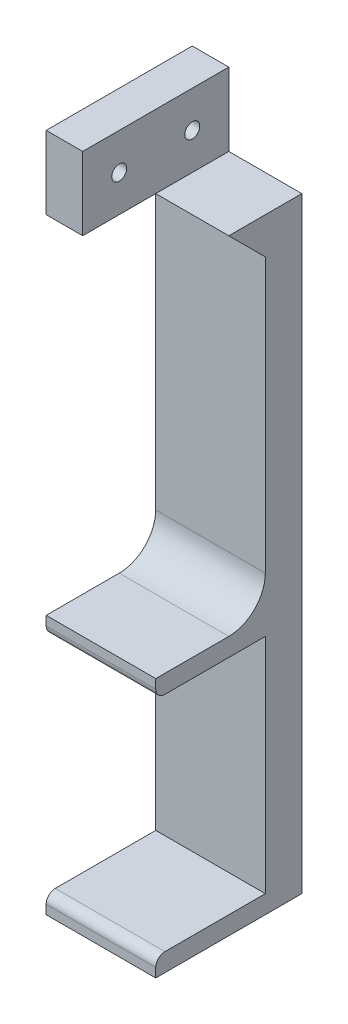
ISO-10303-21;
HEADER;
FILE_DESCRIPTION(('STEP AP214'),'2;1');
FILE_NAME('part.step','',(''),(''),'','','');
FILE_SCHEMA(('AUTOMOTIVE_DESIGN { 1 0 10303 214 1 1 1 1 }'));
ENDSEC;
DATA;
#1=APPLICATION_CONTEXT('core data for automotive mechanical design processes');
#2=APPLICATION_PROTOCOL_DEFINITION('international standard','automotive_design',2000,#1);
#3=PRODUCT_CONTEXT('',#1,'mechanical');
#4=PRODUCT('Part','Part','',(#3));
#5=PRODUCT_RELATED_PRODUCT_CATEGORY('part','',(#4));
#6=PRODUCT_DEFINITION_FORMATION('','',#4);
#7=PRODUCT_DEFINITION_CONTEXT('part definition',#1,'design');
#8=PRODUCT_DEFINITION('design','',#6,#7);
#9=PRODUCT_DEFINITION_SHAPE('','',#8);
#10=(LENGTH_UNIT() NAMED_UNIT(*) SI_UNIT(.MILLI.,.METRE.));
#11=(NAMED_UNIT(*) PLANE_ANGLE_UNIT() SI_UNIT($,.RADIAN.));
#12=(NAMED_UNIT(*) SI_UNIT($,.STERADIAN.) SOLID_ANGLE_UNIT());
#13=UNCERTAINTY_MEASURE_WITH_UNIT(LENGTH_MEASURE(1.E-05),#10,'distance_accuracy_value','');
#14=(GEOMETRIC_REPRESENTATION_CONTEXT(3) GLOBAL_UNCERTAINTY_ASSIGNED_CONTEXT((#13)) GLOBAL_UNIT_ASSIGNED_CONTEXT((#10,
#11,#12)) REPRESENTATION_CONTEXT('',''));
#15=CARTESIAN_POINT('',(0.,0.,0.));
#16=DIRECTION('',(0.,0.,1.));
#17=DIRECTION('',(1.,0.,0.));
#18=AXIS2_PLACEMENT_3D('',#15,#16,#17);
#19=CARTESIAN_POINT('',(-1.79629920025091,150.330357142857,30.));
#20=DIRECTION('',(-1.,0.,0.));
#21=DIRECTION('',(0.,-1.,0.));
#22=AXIS2_PLACEMENT_3D('',#19,#20,#21);
#23=CYLINDRICAL_SURFACE('',#22,2.04999999999999);
#24=CARTESIAN_POINT('',(-1.79629920025091,150.330357142857,30.));
#25=DIRECTION('',(-1.,0.,0.));
#26=DIRECTION('',(0.,-1.,0.));
#27=AXIS2_PLACEMENT_3D('',#24,#25,#26);
#28=CIRCLE('',#27,2.04999999999999);
#29=CARTESIAN_POINT('',(-1.79629920025091,148.280357142857,30.));
#30=VERTEX_POINT('',#29);
#31=EDGE_CURVE('E341',#30,#30,#28,.T.);
#32=ORIENTED_EDGE('',*,*,#31,.F.);
#33=EDGE_LOOP('',(#32));
#34=FACE_BOUND('',#33,.T.);
#35=CARTESIAN_POINT('',(-7.79629920025091,150.330357142857,30.));
#36=DIRECTION('',(-1.,0.,0.));
#37=DIRECTION('',(0.,-1.,0.));
#38=AXIS2_PLACEMENT_3D('',#35,#36,#37);
#39=CIRCLE('',#38,2.04999999999999);
#40=CARTESIAN_POINT('',(-7.79629920025091,148.280357142857,30.));
#41=VERTEX_POINT('',#40);
#42=EDGE_CURVE('E43',#41,#41,#39,.F.);
#43=ORIENTED_EDGE('',*,*,#42,.F.);
#44=EDGE_LOOP('',(#43));
#45=FACE_BOUND('',#44,.T.);
#46=ADVANCED_FACE('F39',(#34,#45),#23,.F.);
#47=CARTESIAN_POINT('',(-1.79629920025091,150.330357142857,10.));
#48=DIRECTION('',(-1.,0.,0.));
#49=DIRECTION('',(0.,-1.,0.));
#50=AXIS2_PLACEMENT_3D('',#47,#48,#49);
#51=CYLINDRICAL_SURFACE('',#50,2.05);
#52=CARTESIAN_POINT('',(-1.79629920025091,150.330357142857,10.));
#53=DIRECTION('',(-1.,0.,0.));
#54=DIRECTION('',(0.,-1.,0.));
#55=AXIS2_PLACEMENT_3D('',#52,#53,#54);
#56=CIRCLE('',#55,2.05);
#57=CARTESIAN_POINT('',(-1.79629920025091,148.280357142857,10.));
#58=VERTEX_POINT('',#57);
#59=EDGE_CURVE('E359',#58,#58,#56,.T.);
#60=ORIENTED_EDGE('',*,*,#59,.F.);
#61=EDGE_LOOP('',(#60));
#62=FACE_BOUND('',#61,.T.);
#63=CARTESIAN_POINT('',(-7.79629920025091,150.330357142857,10.));
#64=DIRECTION('',(-1.,0.,0.));
#65=DIRECTION('',(0.,-1.,0.));
#66=AXIS2_PLACEMENT_3D('',#63,#64,#65);
#67=CIRCLE('',#66,2.05);
#68=CARTESIAN_POINT('',(-7.79629920025091,148.280357142857,10.));
#69=VERTEX_POINT('',#68);
#70=EDGE_CURVE('E332',#69,#69,#67,.F.);
#71=ORIENTED_EDGE('',*,*,#70,.F.);
#72=EDGE_LOOP('',(#71));
#73=FACE_BOUND('',#72,.T.);
#74=ADVANCED_FACE('F433',(#62,#73),#51,.F.);
#75=CARTESIAN_POINT('',(0.,0.,10.));
#76=DIRECTION('',(0.,0.,1.));
#77=DIRECTION('',(1.,0.,0.));
#78=AXIS2_PLACEMENT_3D('',#75,#76,#77);
#79=PLANE('',#78);
#80=DIRECTION('',(0.,1.,0.));
#81=VECTOR('',#80,1.);
#82=CARTESIAN_POINT('',(18.2037007997491,160.330357142857,10.));
#83=LINE('',#82,#81);
#84=CARTESIAN_POINT('',(18.2037007997491,55.3303571428572,10.));
#85=VERTEX_POINT('',#84);
#86=CARTESIAN_POINT('',(18.2037007997491,130.330357142857,10.));
#87=VERTEX_POINT('',#86);
#88=EDGE_CURVE('E254',#85,#87,#83,.T.);
#89=ORIENTED_EDGE('',*,*,#88,.T.);
#90=DIRECTION('',(-1.,0.,0.));
#91=VECTOR('',#90,1.);
#92=CARTESIAN_POINT('',(1.2057980275635E-13,130.330357142857,10.));
#93=LINE('',#92,#91);
#94=CARTESIAN_POINT('',(-11.7962992002509,130.330357142857,10.));
#95=VERTEX_POINT('',#94);
#96=EDGE_CURVE('E328',#87,#95,#93,.T.);
#97=ORIENTED_EDGE('',*,*,#96,.T.);
#98=DIRECTION('',(0.,-1.,0.));
#99=VECTOR('',#98,1.);
#100=CARTESIAN_POINT('',(-11.7962992002509,160.330357142857,10.));
#101=LINE('',#100,#99);
#102=CARTESIAN_POINT('',(-11.7962992002509,55.3303571428572,10.));
#103=VERTEX_POINT('',#102);
#104=EDGE_CURVE('E251',#95,#103,#101,.T.);
#105=ORIENTED_EDGE('',*,*,#104,.T.);
#106=DIRECTION('',(-1.,0.,0.));
#107=VECTOR('',#106,1.);
#108=CARTESIAN_POINT('',(0.,55.3303571428571,10.));
#109=LINE('',#108,#107);
#110=EDGE_CURVE('E315',#103,#85,#109,.F.);
#111=ORIENTED_EDGE('',*,*,#110,.T.);
#112=EDGE_LOOP('',(#89,#97,#105,#111));
#113=FACE_BOUND('',#112,.T.);
#114=ADVANCED_FACE('F439',(#113),#79,.T.);
#115=CARTESIAN_POINT('',(18.2037007997491,-20.6696428571428,10.));
#116=VERTEX_POINT('',#115);
#117=CARTESIAN_POINT('',(18.2037007997491,40.3303571428571,10.));
#118=VERTEX_POINT('',#117);
#119=EDGE_CURVE('E256',#116,#118,#83,.T.);
#120=ORIENTED_EDGE('',*,*,#119,.T.);
#121=DIRECTION('',(1.,0.,0.));
#122=VECTOR('',#121,1.);
#123=CARTESIAN_POINT('',(-11.7962992002509,40.3303571428571,10.));
#124=LINE('',#123,#122);
#125=CARTESIAN_POINT('',(-11.7962992002509,40.3303571428571,10.));
#126=VERTEX_POINT('',#125);
#127=EDGE_CURVE('E201',#126,#118,#124,.T.);
#128=ORIENTED_EDGE('',*,*,#127,.F.);
#129=CARTESIAN_POINT('',(-11.7962992002509,-20.6696428571429,10.));
#130=VERTEX_POINT('',#129);
#131=EDGE_CURVE('E255',#126,#130,#101,.T.);
#132=ORIENTED_EDGE('',*,*,#131,.T.);
#133=DIRECTION('',(-1.,0.,0.));
#134=VECTOR('',#133,1.);
#135=CARTESIAN_POINT('',(-11.7962992002509,-20.6696428571429,10.));
#136=LINE('',#135,#134);
#137=EDGE_CURVE('E229',#116,#130,#136,.T.);
#138=ORIENTED_EDGE('',*,*,#137,.F.);
#139=EDGE_LOOP('',(#120,#128,#132,#138));
#140=FACE_BOUND('',#139,.T.);
#141=ADVANCED_FACE('F409',(#140),#79,.T.);
#142=CARTESIAN_POINT('',(-11.7962992002509,160.330357142857,10.));
#143=DIRECTION('',(1.,0.,0.));
#144=DIRECTION('',(0.,1.,0.));
#145=AXIS2_PLACEMENT_3D('',#142,#143,#144);
#146=PLANE('',#145);
#147=CARTESIAN_POINT('',(-11.7962992002509,150.330357142857,10.));
#148=DIRECTION('',(-1.,0.,0.));
#149=DIRECTION('',(0.,-1.,0.));
#150=AXIS2_PLACEMENT_3D('',#147,#148,#149);
#151=CIRCLE('',#150,3.75);
#152=CARTESIAN_POINT('',(-11.7962992002509,146.580357142857,10.));
#153=VERTEX_POINT('',#152);
#154=EDGE_CURVE('E343',#153,#153,#151,.T.);
#155=ORIENTED_EDGE('',*,*,#154,.F.);
#156=EDGE_LOOP('',(#155));
#157=FACE_BOUND('',#156,.T.);
#158=CARTESIAN_POINT('',(-11.7962992002509,150.330357142857,30.));
#159=DIRECTION('',(-1.,0.,0.));
#160=DIRECTION('',(0.,-1.,0.));
#161=AXIS2_PLACEMENT_3D('',#158,#159,#160);
#162=CIRCLE('',#161,3.75000000000001);
#163=CARTESIAN_POINT('',(-11.7962992002509,146.580357142857,30.));
#164=VERTEX_POINT('',#163);
#165=EDGE_CURVE('E355',#164,#164,#162,.T.);
#166=ORIENTED_EDGE('',*,*,#165,.F.);
#167=EDGE_LOOP('',(#166));
#168=FACE_BOUND('',#167,.T.);
#169=DIRECTION('',(0.,-1.,0.));
#170=VECTOR('',#169,1.);
#171=CARTESIAN_POINT('',(-11.7962992002509,-25.6696428571429,40.));
#172=LINE('',#171,#170);
#173=CARTESIAN_POINT('',(-11.7962992002509,-23.1696428571429,40.));
#174=VERTEX_POINT('',#173);
#175=CARTESIAN_POINT('',(-11.7962992002509,-25.6696428571429,40.));
#176=VERTEX_POINT('',#175);
#177=EDGE_CURVE('E230',#174,#176,#172,.T.);
#178=ORIENTED_EDGE('',*,*,#177,.F.);
#179=CARTESIAN_POINT('',(-11.7962992002509,-23.1696428571429,37.5));
#180=DIRECTION('',(1.,0.,0.));
#181=DIRECTION('',(0.,1.,0.));
#182=AXIS2_PLACEMENT_3D('',#179,#180,#181);
#183=CIRCLE('',#182,2.5);
#184=CARTESIAN_POINT('',(-11.7962992002509,-20.6696428571429,37.5));
#185=VERTEX_POINT('',#184);
#186=EDGE_CURVE('E292',#174,#185,#183,.F.);
#187=ORIENTED_EDGE('',*,*,#186,.T.);
#188=DIRECTION('',(0.,0.,-1.));
#189=VECTOR('',#188,1.);
#190=CARTESIAN_POINT('',(-11.7962992002509,-20.6696428571429,40.));
#191=LINE('',#190,#189);
#192=EDGE_CURVE('E241',#185,#130,#191,.T.);
#193=ORIENTED_EDGE('',*,*,#192,.T.);
#194=ORIENTED_EDGE('',*,*,#131,.F.);
#195=DIRECTION('',(0.,0.,-1.));
#196=VECTOR('',#195,1.);
#197=CARTESIAN_POINT('',(-11.7962992002509,40.3303571428571,40.));
#198=LINE('',#197,#196);
#199=CARTESIAN_POINT('',(-11.7962992002509,40.3303571428571,37.5));
#200=VERTEX_POINT('',#199);
#201=EDGE_CURVE('E226',#200,#126,#198,.T.);
#202=ORIENTED_EDGE('',*,*,#201,.F.);
#203=CARTESIAN_POINT('',(-11.7962992002509,42.8303571428571,37.5));
#204=DIRECTION('',(1.,0.,0.));
#205=DIRECTION('',(0.,1.,0.));
#206=AXIS2_PLACEMENT_3D('',#203,#204,#205);
#207=CIRCLE('',#206,2.5);
#208=CARTESIAN_POINT('',(-11.7962992002509,42.8303571428571,40.));
#209=VERTEX_POINT('',#208);
#210=EDGE_CURVE('E289',#200,#209,#207,.F.);
#211=ORIENTED_EDGE('',*,*,#210,.T.);
#212=DIRECTION('',(0.,-1.,0.));
#213=VECTOR('',#212,1.);
#214=CARTESIAN_POINT('',(-11.7962992002509,45.3303571428571,40.));
#215=LINE('',#214,#213);
#216=CARTESIAN_POINT('',(-11.7962992002509,45.3303571428571,40.));
#217=VERTEX_POINT('',#216);
#218=EDGE_CURVE('E202',#217,#209,#215,.T.);
#219=ORIENTED_EDGE('',*,*,#218,.F.);
#220=DIRECTION('',(0.,0.,-1.));
#221=VECTOR('',#220,1.);
#222=CARTESIAN_POINT('',(-11.7962992002509,45.3303571428571,40.));
#223=LINE('',#222,#221);
#224=CARTESIAN_POINT('',(-11.7962992002509,45.3303571428571,20.));
#225=VERTEX_POINT('',#224);
#226=EDGE_CURVE('E212',#217,#225,#223,.T.);
#227=ORIENTED_EDGE('',*,*,#226,.T.);
#228=CARTESIAN_POINT('',(-11.7962992002509,55.3303571428571,20.));
#229=DIRECTION('',(1.,0.,0.));
#230=DIRECTION('',(0.,1.,0.));
#231=AXIS2_PLACEMENT_3D('',#228,#229,#230);
#232=CIRCLE('',#231,10.);
#233=EDGE_CURVE('E318',#225,#103,#232,.T.);
#234=ORIENTED_EDGE('',*,*,#233,.T.);
#235=ORIENTED_EDGE('',*,*,#104,.F.);
#236=DIRECTION('',(0.,0.707106781186542,0.707106781186553));
#237=VECTOR('',#236,1.);
#238=CARTESIAN_POINT('',(-11.7962992002509,145.330357142857,25.));
#239=LINE('',#238,#237);
#240=CARTESIAN_POINT('',(-11.7962992002509,140.330357142857,20.0000000000001));
#241=VERTEX_POINT('',#240);
#242=EDGE_CURVE('E11',#95,#241,#239,.T.);
#243=ORIENTED_EDGE('',*,*,#242,.T.);
#244=DIRECTION('',(0.,0.,-1.));
#245=VECTOR('',#244,1.);
#246=CARTESIAN_POINT('',(-11.7962992002509,140.330357142857,40.));
#247=LINE('',#246,#245);
#248=CARTESIAN_POINT('',(-11.7962992002509,140.330357142857,40.));
#249=VERTEX_POINT('',#248);
#250=EDGE_CURVE('E193',#249,#241,#247,.T.);
#251=ORIENTED_EDGE('',*,*,#250,.F.);
#252=DIRECTION('',(0.,-1.,0.));
#253=VECTOR('',#252,1.);
#254=CARTESIAN_POINT('',(-11.7962992002509,160.330357142857,40.));
#255=LINE('',#254,#253);
#256=CARTESIAN_POINT('',(-11.7962992002509,160.330357142857,40.));
#257=VERTEX_POINT('',#256);
#258=EDGE_CURVE('E186',#257,#249,#255,.T.);
#259=ORIENTED_EDGE('',*,*,#258,.F.);
#260=DIRECTION('',(0.,0.,-1.));
#261=VECTOR('',#260,1.);
#262=CARTESIAN_POINT('',(-11.7962992002509,160.330357142857,10.));
#263=LINE('',#262,#261);
#264=CARTESIAN_POINT('',(-11.7962992002509,160.330357142857,0.));
#265=VERTEX_POINT('',#264);
#266=EDGE_CURVE('E260',#257,#265,#263,.T.);
#267=ORIENTED_EDGE('',*,*,#266,.T.);
#268=DIRECTION('',(0.,-1.,0.));
#269=VECTOR('',#268,1.);
#270=CARTESIAN_POINT('',(-11.7962992002509,160.330357142857,0.));
#271=LINE('',#270,#269);
#272=CARTESIAN_POINT('',(-11.7962992002509,-25.6696428571429,0.));
#273=VERTEX_POINT('',#272);
#274=EDGE_CURVE('E250',#265,#273,#271,.T.);
#275=ORIENTED_EDGE('',*,*,#274,.T.);
#276=DIRECTION('',(0.,0.,-1.));
#277=VECTOR('',#276,1.);
#278=CARTESIAN_POINT('',(-11.7962992002509,-25.6696428571429,10.));
#279=LINE('',#278,#277);
#280=EDGE_CURVE('E281',#176,#273,#279,.T.);
#281=ORIENTED_EDGE('',*,*,#280,.F.);
#282=EDGE_LOOP('',(#178,#187,#193,#194,#202,#211,#219,#227,#234,#235,#243,#251,#259,#267,#275,#281));
#283=FACE_BOUND('',#282,.T.);
#284=ADVANCED_FACE('F391',(#157,#168,#283),#146,.F.);
#285=CARTESIAN_POINT('',(-11.7962992002509,-25.6696428571429,10.));
#286=DIRECTION('',(0.,1.,0.));
#287=DIRECTION('',(0.,0.,1.));
#288=AXIS2_PLACEMENT_3D('',#285,#286,#287);
#289=PLANE('',#288);
#290=DIRECTION('',(1.,0.,0.));
#291=VECTOR('',#290,1.);
#292=CARTESIAN_POINT('',(-11.7962992002509,-25.6696428571429,0.));
#293=LINE('',#292,#291);
#294=CARTESIAN_POINT('',(18.2037007997491,-25.6696428571429,0.));
#295=VERTEX_POINT('',#294);
#296=EDGE_CURVE('E264',#273,#295,#293,.T.);
#297=ORIENTED_EDGE('',*,*,#296,.T.);
#298=DIRECTION('',(0.,0.,-1.));
#299=VECTOR('',#298,1.);
#300=CARTESIAN_POINT('',(18.2037007997491,-25.6696428571429,10.));
#301=LINE('',#300,#299);
#302=CARTESIAN_POINT('',(18.2037007997491,-25.6696428571429,40.));
#303=VERTEX_POINT('',#302);
#304=EDGE_CURVE('E277',#303,#295,#301,.T.);
#305=ORIENTED_EDGE('',*,*,#304,.F.);
#306=DIRECTION('',(1.,0.,0.));
#307=VECTOR('',#306,1.);
#308=CARTESIAN_POINT('',(-11.7962992002509,-25.6696428571429,40.));
#309=LINE('',#308,#307);
#310=EDGE_CURVE('E233',#176,#303,#309,.T.);
#311=ORIENTED_EDGE('',*,*,#310,.F.);
#312=ORIENTED_EDGE('',*,*,#280,.T.);
#313=EDGE_LOOP('',(#297,#305,#311,#312));
#314=FACE_BOUND('',#313,.T.);
#315=ADVANCED_FACE('F384',(#314),#289,.F.);
#316=CARTESIAN_POINT('',(18.2037007997491,160.330357142857,10.));
#317=DIRECTION('',(-1.,0.,0.));
#318=DIRECTION('',(0.,-1.,0.));
#319=AXIS2_PLACEMENT_3D('',#316,#317,#318);
#320=PLANE('',#319);
#321=DIRECTION('',(0.,1.,0.));
#322=VECTOR('',#321,1.);
#323=CARTESIAN_POINT('',(18.2037007997491,160.330357142857,0.));
#324=LINE('',#323,#322);
#325=CARTESIAN_POINT('',(18.2037007997491,140.330357142857,0.));
#326=VERTEX_POINT('',#325);
#327=EDGE_CURVE('E267',#295,#326,#324,.T.);
#328=ORIENTED_EDGE('',*,*,#327,.T.);
#329=DIRECTION('',(0.,0.,-1.));
#330=VECTOR('',#329,1.);
#331=CARTESIAN_POINT('',(18.2037007997491,140.330357142857,40.));
#332=LINE('',#331,#330);
#333=CARTESIAN_POINT('',(18.2037007997491,140.330357142857,20.0000000000001));
#334=VERTEX_POINT('',#333);
#335=EDGE_CURVE('E171',#334,#326,#332,.T.);
#336=ORIENTED_EDGE('',*,*,#335,.F.);
#337=DIRECTION('',(0.,-0.707106781186542,-0.707106781186553));
#338=VECTOR('',#337,1.);
#339=CARTESIAN_POINT('',(18.2037007997491,145.330357142857,25.));
#340=LINE('',#339,#338);
#341=EDGE_CURVE('E49',#334,#87,#340,.T.);
#342=ORIENTED_EDGE('',*,*,#341,.T.);
#343=ORIENTED_EDGE('',*,*,#88,.F.);
#344=CARTESIAN_POINT('',(18.2037007997491,55.3303571428571,20.));
#345=DIRECTION('',(-1.,0.,0.));
#346=DIRECTION('',(0.,-1.,0.));
#347=AXIS2_PLACEMENT_3D('',#344,#345,#346);
#348=CIRCLE('',#347,10.);
#349=CARTESIAN_POINT('',(18.2037007997491,45.3303571428571,20.));
#350=VERTEX_POINT('',#349);
#351=EDGE_CURVE('E322',#85,#350,#348,.T.);
#352=ORIENTED_EDGE('',*,*,#351,.T.);
#353=DIRECTION('',(0.,0.,-1.));
#354=VECTOR('',#353,1.);
#355=CARTESIAN_POINT('',(18.2037007997491,45.3303571428571,40.));
#356=LINE('',#355,#354);
#357=CARTESIAN_POINT('',(18.2037007997491,45.3303571428571,40.));
#358=VERTEX_POINT('',#357);
#359=EDGE_CURVE('E219',#358,#350,#356,.T.);
#360=ORIENTED_EDGE('',*,*,#359,.F.);
#361=DIRECTION('',(0.,1.,0.));
#362=VECTOR('',#361,1.);
#363=CARTESIAN_POINT('',(18.2037007997491,45.3303571428571,40.));
#364=LINE('',#363,#362);
#365=CARTESIAN_POINT('',(18.2037007997491,42.8303571428571,40.));
#366=VERTEX_POINT('',#365);
#367=EDGE_CURVE('E206',#366,#358,#364,.T.);
#368=ORIENTED_EDGE('',*,*,#367,.F.);
#369=CARTESIAN_POINT('',(18.2037007997491,42.8303571428571,37.5));
#370=DIRECTION('',(-1.,0.,0.));
#371=DIRECTION('',(0.,-1.,0.));
#372=AXIS2_PLACEMENT_3D('',#369,#370,#371);
#373=CIRCLE('',#372,2.5);
#374=CARTESIAN_POINT('',(18.2037007997491,40.3303571428571,37.5));
#375=VERTEX_POINT('',#374);
#376=EDGE_CURVE('E298',#366,#375,#373,.F.);
#377=ORIENTED_EDGE('',*,*,#376,.T.);
#378=DIRECTION('',(0.,0.,-1.));
#379=VECTOR('',#378,1.);
#380=CARTESIAN_POINT('',(18.2037007997491,40.3303571428571,40.));
#381=LINE('',#380,#379);
#382=EDGE_CURVE('E223',#375,#118,#381,.T.);
#383=ORIENTED_EDGE('',*,*,#382,.T.);
#384=ORIENTED_EDGE('',*,*,#119,.F.);
#385=DIRECTION('',(0.,0.,-1.));
#386=VECTOR('',#385,1.);
#387=CARTESIAN_POINT('',(18.2037007997491,-20.6696428571429,40.));
#388=LINE('',#387,#386);
#389=CARTESIAN_POINT('',(18.2037007997491,-20.6696428571429,37.5));
#390=VERTEX_POINT('',#389);
#391=EDGE_CURVE('E247',#390,#116,#388,.T.);
#392=ORIENTED_EDGE('',*,*,#391,.F.);
#393=CARTESIAN_POINT('',(18.2037007997491,-23.1696428571429,37.5));
#394=DIRECTION('',(-1.,0.,0.));
#395=DIRECTION('',(0.,-1.,0.));
#396=AXIS2_PLACEMENT_3D('',#393,#394,#395);
#397=CIRCLE('',#396,2.5);
#398=CARTESIAN_POINT('',(18.2037007997491,-23.1696428571429,40.));
#399=VERTEX_POINT('',#398);
#400=EDGE_CURVE('E301',#390,#399,#397,.F.);
#401=ORIENTED_EDGE('',*,*,#400,.T.);
#402=DIRECTION('',(0.,1.,0.));
#403=VECTOR('',#402,1.);
#404=CARTESIAN_POINT('',(18.2037007997491,-25.6696428571429,40.));
#405=LINE('',#404,#403);
#406=EDGE_CURVE('E237',#303,#399,#405,.T.);
#407=ORIENTED_EDGE('',*,*,#406,.F.);
#408=ORIENTED_EDGE('',*,*,#304,.T.);
#409=EDGE_LOOP('',(#328,#336,#342,#343,#352,#360,#368,#377,#383,#384,#392,#401,#407,#408));
#410=FACE_BOUND('',#409,.T.);
#411=ADVANCED_FACE('F380',(#410),#320,.F.);
#412=CARTESIAN_POINT('',(-11.7962992002509,160.330357142857,10.));
#413=DIRECTION('',(0.,-1.,0.));
#414=DIRECTION('',(0.,0.,-1.));
#415=AXIS2_PLACEMENT_3D('',#412,#413,#414);
#416=PLANE('',#415);
#417=DIRECTION('',(-1.,0.,0.));
#418=VECTOR('',#417,1.);
#419=CARTESIAN_POINT('',(-11.7962992002509,160.330357142857,40.));
#420=LINE('',#419,#418);
#421=CARTESIAN_POINT('',(-1.79629920025092,160.330357142857,40.));
#422=VERTEX_POINT('',#421);
#423=EDGE_CURVE('E189',#422,#257,#420,.T.);
#424=ORIENTED_EDGE('',*,*,#423,.F.);
#425=DIRECTION('',(0.,0.,1.));
#426=VECTOR('',#425,1.);
#427=CARTESIAN_POINT('',(-1.79629920025092,160.330357142857,40.));
#428=LINE('',#427,#426);
#429=CARTESIAN_POINT('',(-1.79629920025092,160.330357142857,0.));
#430=VERTEX_POINT('',#429);
#431=EDGE_CURVE('E165',#430,#422,#428,.T.);
#432=ORIENTED_EDGE('',*,*,#431,.F.);
#433=DIRECTION('',(-1.,0.,0.));
#434=VECTOR('',#433,1.);
#435=CARTESIAN_POINT('',(-11.7962992002509,160.330357142857,0.));
#436=LINE('',#435,#434);
#437=EDGE_CURVE('E271',#430,#265,#436,.T.);
#438=ORIENTED_EDGE('',*,*,#437,.T.);
#439=ORIENTED_EDGE('',*,*,#266,.F.);
#440=EDGE_LOOP('',(#424,#432,#438,#439));
#441=FACE_BOUND('',#440,.T.);
#442=ADVANCED_FACE('F395',(#441),#416,.F.);
#443=CARTESIAN_POINT('',(0.,0.,0.));
#444=DIRECTION('',(0.,0.,1.));
#445=DIRECTION('',(1.,0.,0.));
#446=AXIS2_PLACEMENT_3D('',#443,#444,#445);
#447=PLANE('',#446);
#448=DIRECTION('',(0.,1.,0.));
#449=VECTOR('',#448,1.);
#450=CARTESIAN_POINT('',(-1.79629920025091,140.330357142857,0.));
#451=LINE('',#450,#449);
#452=CARTESIAN_POINT('',(-1.79629920025091,140.330357142857,0.));
#453=VERTEX_POINT('',#452);
#454=EDGE_CURVE('E182',#453,#430,#451,.T.);
#455=ORIENTED_EDGE('',*,*,#454,.F.);
#456=DIRECTION('',(1.,0.,0.));
#457=VECTOR('',#456,1.);
#458=CARTESIAN_POINT('',(-1.79629920025091,140.330357142857,0.));
#459=LINE('',#458,#457);
#460=EDGE_CURVE('E195',#453,#326,#459,.T.);
#461=ORIENTED_EDGE('',*,*,#460,.T.);
#462=ORIENTED_EDGE('',*,*,#327,.F.);
#463=ORIENTED_EDGE('',*,*,#296,.F.);
#464=ORIENTED_EDGE('',*,*,#274,.F.);
#465=ORIENTED_EDGE('',*,*,#437,.F.);
#466=EDGE_LOOP('',(#455,#461,#462,#463,#464,#465));
#467=FACE_BOUND('',#466,.T.);
#468=ADVANCED_FACE('F377',(#467),#447,.F.);
#469=CARTESIAN_POINT('',(-11.7962992002509,-20.6696428571429,40.));
#470=DIRECTION('',(0.,-1.,0.));
#471=DIRECTION('',(0.,0.,-1.));
#472=AXIS2_PLACEMENT_3D('',#469,#470,#471);
#473=PLANE('',#472);
#474=ORIENTED_EDGE('',*,*,#192,.F.);
#475=DIRECTION('',(-1.,0.,0.));
#476=VECTOR('',#475,1.);
#477=CARTESIAN_POINT('',(-11.7962992002509,-20.6696428571429,37.5));
#478=LINE('',#477,#476);
#479=EDGE_CURVE('E295',#185,#390,#478,.F.);
#480=ORIENTED_EDGE('',*,*,#479,.T.);
#481=ORIENTED_EDGE('',*,*,#391,.T.);
#482=ORIENTED_EDGE('',*,*,#137,.T.);
#483=EDGE_LOOP('',(#474,#480,#481,#482));
#484=FACE_BOUND('',#483,.T.);
#485=ADVANCED_FACE('F414',(#484),#473,.F.);
#486=CARTESIAN_POINT('',(0.,0.,40.));
#487=DIRECTION('',(0.,0.,-1.));
#488=DIRECTION('',(-1.,0.,0.));
#489=AXIS2_PLACEMENT_3D('',#486,#487,#488);
#490=PLANE('',#489);
#491=ORIENTED_EDGE('',*,*,#406,.T.);
#492=DIRECTION('',(-1.,0.,0.));
#493=VECTOR('',#492,1.);
#494=CARTESIAN_POINT('',(0.,-23.1696428571429,40.));
#495=LINE('',#494,#493);
#496=EDGE_CURVE('E285',#399,#174,#495,.T.);
#497=ORIENTED_EDGE('',*,*,#496,.T.);
#498=ORIENTED_EDGE('',*,*,#177,.T.);
#499=ORIENTED_EDGE('',*,*,#310,.T.);
#500=EDGE_LOOP('',(#491,#497,#498,#499));
#501=FACE_BOUND('',#500,.T.);
#502=ADVANCED_FACE('F386',(#501),#490,.F.);
#503=CARTESIAN_POINT('',(-11.7962992002509,40.3303571428571,40.));
#504=DIRECTION('',(0.,1.,0.));
#505=DIRECTION('',(0.,0.,1.));
#506=AXIS2_PLACEMENT_3D('',#503,#504,#505);
#507=PLANE('',#506);
#508=ORIENTED_EDGE('',*,*,#382,.F.);
#509=DIRECTION('',(1.,0.,0.));
#510=VECTOR('',#509,1.);
#511=CARTESIAN_POINT('',(-11.7962992002509,40.3303571428571,37.5));
#512=LINE('',#511,#510);
#513=EDGE_CURVE('E308',#375,#200,#512,.F.);
#514=ORIENTED_EDGE('',*,*,#513,.T.);
#515=ORIENTED_EDGE('',*,*,#201,.T.);
#516=ORIENTED_EDGE('',*,*,#127,.T.);
#517=EDGE_LOOP('',(#508,#514,#515,#516));
#518=FACE_BOUND('',#517,.T.);
#519=ADVANCED_FACE('F462',(#518),#507,.F.);
#520=CARTESIAN_POINT('',(-11.7962992002509,45.3303571428571,40.));
#521=DIRECTION('',(0.,-1.,0.));
#522=DIRECTION('',(0.,0.,-1.));
#523=AXIS2_PLACEMENT_3D('',#520,#521,#522);
#524=PLANE('',#523);
#525=ORIENTED_EDGE('',*,*,#359,.T.);
#526=DIRECTION('',(-1.,0.,0.));
#527=VECTOR('',#526,1.);
#528=CARTESIAN_POINT('',(-11.7962992002509,45.3303571428571,20.));
#529=LINE('',#528,#527);
#530=EDGE_CURVE('E311',#350,#225,#529,.T.);
#531=ORIENTED_EDGE('',*,*,#530,.T.);
#532=ORIENTED_EDGE('',*,*,#226,.F.);
#533=DIRECTION('',(-1.,0.,0.));
#534=VECTOR('',#533,1.);
#535=CARTESIAN_POINT('',(-11.7962992002509,45.3303571428571,40.));
#536=LINE('',#535,#534);
#537=EDGE_CURVE('E209',#358,#217,#536,.T.);
#538=ORIENTED_EDGE('',*,*,#537,.F.);
#539=EDGE_LOOP('',(#525,#531,#532,#538));
#540=FACE_BOUND('',#539,.T.);
#541=ADVANCED_FACE('F458',(#540),#524,.F.);
#542=CARTESIAN_POINT('',(0.,0.,40.));
#543=DIRECTION('',(0.,0.,1.));
#544=DIRECTION('',(1.,0.,0.));
#545=AXIS2_PLACEMENT_3D('',#542,#543,#544);
#546=PLANE('',#545);
#547=ORIENTED_EDGE('',*,*,#218,.T.);
#548=DIRECTION('',(1.,0.,0.));
#549=VECTOR('',#548,1.);
#550=CARTESIAN_POINT('',(18.2037007997491,42.8303571428571,40.));
#551=LINE('',#550,#549);
#552=EDGE_CURVE('E304',#209,#366,#551,.T.);
#553=ORIENTED_EDGE('',*,*,#552,.T.);
#554=ORIENTED_EDGE('',*,*,#367,.T.);
#555=ORIENTED_EDGE('',*,*,#537,.T.);
#556=EDGE_LOOP('',(#547,#553,#554,#555));
#557=FACE_BOUND('',#556,.T.);
#558=ADVANCED_FACE('F455',(#557),#546,.T.);
#559=CARTESIAN_POINT('',(-11.7962992002509,140.330357142857,40.));
#560=DIRECTION('',(0.,1.,0.));
#561=DIRECTION('',(-1.,0.,0.));
#562=AXIS2_PLACEMENT_3D('',#559,#560,#561);
#563=PLANE('',#562);
#564=DIRECTION('',(1.,0.,0.));
#565=VECTOR('',#564,1.);
#566=CARTESIAN_POINT('',(-11.7962992002509,140.330357142857,20.0000000000001));
#567=LINE('',#566,#565);
#568=CARTESIAN_POINT('',(-1.79629920025091,140.330357142857,20.0000000000001));
#569=VERTEX_POINT('',#568);
#570=EDGE_CURVE('E180',#241,#569,#567,.T.);
#571=ORIENTED_EDGE('',*,*,#570,.T.);
#572=DIRECTION('',(0.,0.,-1.));
#573=VECTOR('',#572,1.);
#574=CARTESIAN_POINT('',(-1.79629920025091,140.330357142857,40.));
#575=LINE('',#574,#573);
#576=CARTESIAN_POINT('',(-1.79629920025091,140.330357142857,40.));
#577=VERTEX_POINT('',#576);
#578=EDGE_CURVE('E57',#577,#569,#575,.T.);
#579=ORIENTED_EDGE('',*,*,#578,.F.);
#580=DIRECTION('',(1.,0.,0.));
#581=VECTOR('',#580,1.);
#582=CARTESIAN_POINT('',(-11.7962992002509,140.330357142857,40.));
#583=LINE('',#582,#581);
#584=EDGE_CURVE('E177',#249,#577,#583,.T.);
#585=ORIENTED_EDGE('',*,*,#584,.F.);
#586=ORIENTED_EDGE('',*,*,#250,.T.);
#587=EDGE_LOOP('',(#571,#579,#585,#586));
#588=FACE_BOUND('',#587,.T.);
#589=ADVANCED_FACE('F175',(#588),#563,.F.);
#590=CARTESIAN_POINT('',(0.,0.,40.));
#591=DIRECTION('',(0.,0.,1.));
#592=DIRECTION('',(1.,0.,0.));
#593=AXIS2_PLACEMENT_3D('',#590,#591,#592);
#594=PLANE('',#593);
#595=DIRECTION('',(0.,-1.,0.));
#596=VECTOR('',#595,1.);
#597=CARTESIAN_POINT('',(-1.79629920025091,140.330357142857,40.));
#598=LINE('',#597,#596);
#599=EDGE_CURVE('E162',#422,#577,#598,.T.);
#600=ORIENTED_EDGE('',*,*,#599,.F.);
#601=ORIENTED_EDGE('',*,*,#423,.T.);
#602=ORIENTED_EDGE('',*,*,#258,.T.);
#603=ORIENTED_EDGE('',*,*,#584,.T.);
#604=EDGE_LOOP('',(#600,#601,#602,#603));
#605=FACE_BOUND('',#604,.T.);
#606=ADVANCED_FACE('F184',(#605),#594,.T.);
#607=CARTESIAN_POINT('',(0.,-23.1696428571429,37.5));
#608=DIRECTION('',(-1.,0.,0.));
#609=DIRECTION('',(0.,0.,1.));
#610=AXIS2_PLACEMENT_3D('',#607,#608,#609);
#611=CYLINDRICAL_SURFACE('',#610,2.5);
#612=ORIENTED_EDGE('',*,*,#400,.F.);
#613=ORIENTED_EDGE('',*,*,#479,.F.);
#614=ORIENTED_EDGE('',*,*,#186,.F.);
#615=ORIENTED_EDGE('',*,*,#496,.F.);
#616=EDGE_LOOP('',(#612,#613,#614,#615));
#617=FACE_BOUND('',#616,.T.);
#618=ADVANCED_FACE('F419',(#617),#611,.T.);
#619=CARTESIAN_POINT('',(0.,42.8303571428571,37.5));
#620=DIRECTION('',(-1.,0.,0.));
#621=DIRECTION('',(0.,0.,1.));
#622=AXIS2_PLACEMENT_3D('',#619,#620,#621);
#623=CYLINDRICAL_SURFACE('',#622,2.5);
#624=ORIENTED_EDGE('',*,*,#210,.F.);
#625=ORIENTED_EDGE('',*,*,#513,.F.);
#626=ORIENTED_EDGE('',*,*,#376,.F.);
#627=ORIENTED_EDGE('',*,*,#552,.F.);
#628=EDGE_LOOP('',(#624,#625,#626,#627));
#629=FACE_BOUND('',#628,.T.);
#630=ADVANCED_FACE('F421',(#629),#623,.T.);
#631=CARTESIAN_POINT('',(-11.7962992002509,55.3303571428571,20.));
#632=DIRECTION('',(-1.,0.,0.));
#633=DIRECTION('',(0.,0.,1.));
#634=AXIS2_PLACEMENT_3D('',#631,#632,#633);
#635=CYLINDRICAL_SURFACE('',#634,10.);
#636=ORIENTED_EDGE('',*,*,#351,.F.);
#637=ORIENTED_EDGE('',*,*,#110,.F.);
#638=ORIENTED_EDGE('',*,*,#233,.F.);
#639=ORIENTED_EDGE('',*,*,#530,.F.);
#640=EDGE_LOOP('',(#636,#637,#638,#639));
#641=FACE_BOUND('',#640,.T.);
#642=ADVANCED_FACE('F427',(#641),#635,.F.);
#643=CARTESIAN_POINT('',(-11.7962992002509,140.330357142857,20.0000000000001));
#644=DIRECTION('',(0.,0.707106781186553,-0.707106781186542));
#645=DIRECTION('',(1.,0.,0.));
#646=AXIS2_PLACEMENT_3D('',#643,#644,#645);
#647=PLANE('',#646);
#648=ORIENTED_EDGE('',*,*,#242,.F.);
#649=ORIENTED_EDGE('',*,*,#96,.F.);
#650=ORIENTED_EDGE('',*,*,#341,.F.);
#651=EDGE_CURVE('E325',#569,#334,#567,.T.);
#652=ORIENTED_EDGE('',*,*,#651,.F.);
#653=ORIENTED_EDGE('',*,*,#570,.F.);
#654=EDGE_LOOP('',(#648,#649,#650,#652,#653));
#655=FACE_BOUND('',#654,.T.);
#656=ADVANCED_FACE('F41',(#655),#647,.F.);
#657=CARTESIAN_POINT('',(-1.79629920025091,140.330357142857,40.));
#658=DIRECTION('',(0.,-1.,0.));
#659=DIRECTION('',(1.,0.,0.));
#660=AXIS2_PLACEMENT_3D('',#657,#658,#659);
#661=PLANE('',#660);
#662=ORIENTED_EDGE('',*,*,#335,.T.);
#663=ORIENTED_EDGE('',*,*,#460,.F.);
#664=EDGE_CURVE('E170',#569,#453,#575,.T.);
#665=ORIENTED_EDGE('',*,*,#664,.F.);
#666=ORIENTED_EDGE('',*,*,#651,.T.);
#667=EDGE_LOOP('',(#662,#663,#665,#666));
#668=FACE_BOUND('',#667,.T.);
#669=ADVANCED_FACE('F449',(#668),#661,.F.);
#670=CARTESIAN_POINT('',(-1.79629920025089,0.,0.));
#671=DIRECTION('',(-1.,0.,0.));
#672=DIRECTION('',(0.,-1.,0.));
#673=AXIS2_PLACEMENT_3D('',#670,#671,#672);
#674=PLANE('',#673);
#675=ORIENTED_EDGE('',*,*,#59,.T.);
#676=EDGE_LOOP('',(#675));
#677=FACE_BOUND('',#676,.T.);
#678=ORIENTED_EDGE('',*,*,#31,.T.);
#679=EDGE_LOOP('',(#678));
#680=FACE_BOUND('',#679,.T.);
#681=ORIENTED_EDGE('',*,*,#599,.T.);
#682=ORIENTED_EDGE('',*,*,#578,.T.);
#683=ORIENTED_EDGE('',*,*,#664,.T.);
#684=ORIENTED_EDGE('',*,*,#454,.T.);
#685=ORIENTED_EDGE('',*,*,#431,.T.);
#686=EDGE_LOOP('',(#681,#682,#683,#684,#685));
#687=FACE_BOUND('',#686,.T.);
#688=ADVANCED_FACE('F163',(#677,#680,#687),#674,.F.);
#689=CARTESIAN_POINT('',(-7.79629920025091,150.330357142857,10.));
#690=DIRECTION('',(-1.,0.,0.));
#691=DIRECTION('',(0.,-1.,0.));
#692=AXIS2_PLACEMENT_3D('',#689,#690,#691);
#693=PLANE('',#692);
#694=CARTESIAN_POINT('',(-7.79629920025091,150.330357142857,10.));
#695=DIRECTION('',(-1.,0.,0.));
#696=DIRECTION('',(0.,-1.,0.));
#697=AXIS2_PLACEMENT_3D('',#694,#695,#696);
#698=CIRCLE('',#697,3.75);
#699=CARTESIAN_POINT('',(-7.79629920025091,146.580357142857,10.));
#700=VERTEX_POINT('',#699);
#701=EDGE_CURVE('E335',#700,#700,#698,.T.);
#702=ORIENTED_EDGE('',*,*,#701,.T.);
#703=EDGE_LOOP('',(#702));
#704=FACE_BOUND('',#703,.T.);
#705=ORIENTED_EDGE('',*,*,#70,.T.);
#706=EDGE_LOOP('',(#705));
#707=FACE_BOUND('',#706,.T.);
#708=ADVANCED_FACE('F448',(#704,#707),#693,.T.);
#709=CARTESIAN_POINT('',(-7.79629920025091,150.330357142857,10.));
#710=DIRECTION('',(-1.,0.,0.));
#711=DIRECTION('',(0.,-1.,0.));
#712=AXIS2_PLACEMENT_3D('',#709,#710,#711);
#713=CYLINDRICAL_SURFACE('',#712,3.75);
#714=ORIENTED_EDGE('',*,*,#701,.F.);
#715=EDGE_LOOP('',(#714));
#716=FACE_BOUND('',#715,.T.);
#717=ORIENTED_EDGE('',*,*,#154,.T.);
#718=EDGE_LOOP('',(#717));
#719=FACE_BOUND('',#718,.T.);
#720=ADVANCED_FACE('F495',(#716,#719),#713,.F.);
#721=CARTESIAN_POINT('',(-7.79629920025091,150.330357142857,30.));
#722=DIRECTION('',(-1.,0.,0.));
#723=DIRECTION('',(0.,-1.,0.));
#724=AXIS2_PLACEMENT_3D('',#721,#722,#723);
#725=PLANE('',#724);
#726=CARTESIAN_POINT('',(-7.79629920025091,150.330357142857,30.));
#727=DIRECTION('',(-1.,0.,0.));
#728=DIRECTION('',(0.,-1.,0.));
#729=AXIS2_PLACEMENT_3D('',#726,#727,#728);
#730=CIRCLE('',#729,3.75000000000001);
#731=CARTESIAN_POINT('',(-7.79629920025091,146.580357142857,30.));
#732=VERTEX_POINT('',#731);
#733=EDGE_CURVE('E349',#732,#732,#730,.T.);
#734=ORIENTED_EDGE('',*,*,#733,.T.);
#735=EDGE_LOOP('',(#734));
#736=FACE_BOUND('',#735,.T.);
#737=ORIENTED_EDGE('',*,*,#42,.T.);
#738=EDGE_LOOP('',(#737));
#739=FACE_BOUND('',#738,.T.);
#740=ADVANCED_FACE('F490',(#736,#739),#725,.T.);
#741=CARTESIAN_POINT('',(-7.79629920025091,150.330357142857,30.));
#742=DIRECTION('',(-1.,0.,0.));
#743=DIRECTION('',(0.,-1.,0.));
#744=AXIS2_PLACEMENT_3D('',#741,#742,#743);
#745=CYLINDRICAL_SURFACE('',#744,3.75000000000001);
#746=ORIENTED_EDGE('',*,*,#733,.F.);
#747=EDGE_LOOP('',(#746));
#748=FACE_BOUND('',#747,.T.);
#749=ORIENTED_EDGE('',*,*,#165,.T.);
#750=EDGE_LOOP('',(#749));
#751=FACE_BOUND('',#750,.T.);
#752=ADVANCED_FACE('F488',(#748,#751),#745,.F.);
#753=CLOSED_SHELL('',(#46,#74,#114,#141,#284,#315,#411,#442,#468,#485,#502,#519,#541,#558,#589,
#606,#618,#630,#642,#656,#669,#688,#708,#720,#740,#752));
#754=MANIFOLD_SOLID_BREP('B2',#753);
#755=ADVANCED_BREP_SHAPE_REPRESENTATION('',(#18,#754),#14);
#756=SHAPE_DEFINITION_REPRESENTATION(#9,#755);
ENDSEC;
END-ISO-10303-21;
